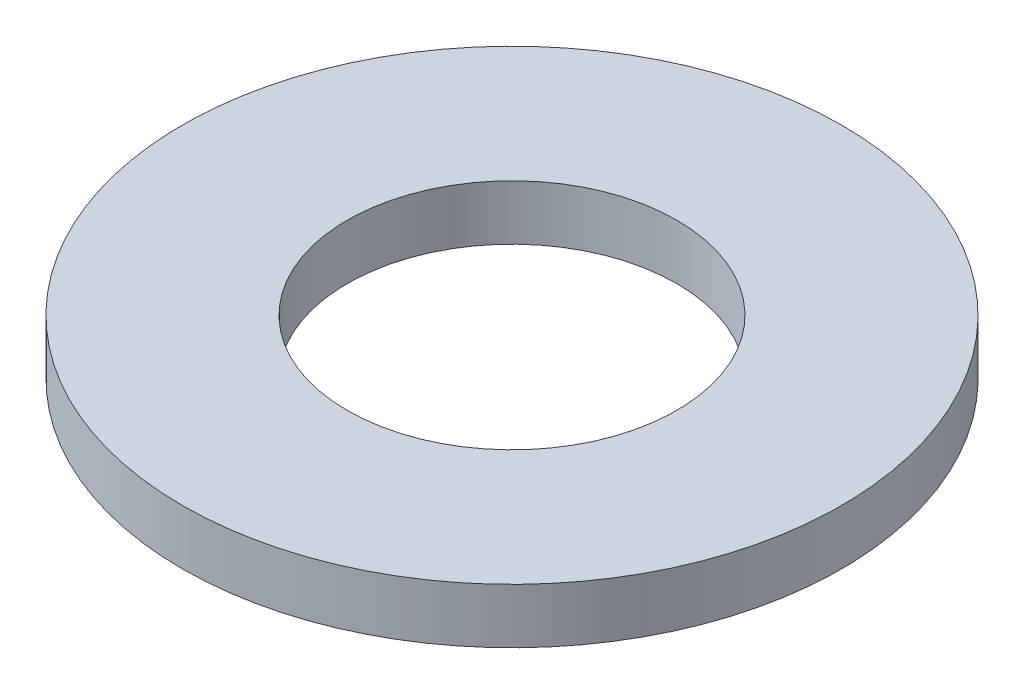
ISO-10303-21;
HEADER;
FILE_DESCRIPTION(('STEP AP214'),'2;1');
FILE_NAME('part.step','',(''),(''),'','','');
FILE_SCHEMA(('AUTOMOTIVE_DESIGN { 1 0 10303 214 1 1 1 1 }'));
ENDSEC;
DATA;
#1=APPLICATION_CONTEXT('core data for automotive mechanical design processes');
#2=APPLICATION_PROTOCOL_DEFINITION('international standard','automotive_design',2000,#1);
#3=PRODUCT_CONTEXT('',#1,'mechanical');
#4=PRODUCT('Part','Part','',(#3));
#5=PRODUCT_RELATED_PRODUCT_CATEGORY('part','',(#4));
#6=PRODUCT_DEFINITION_FORMATION('','',#4);
#7=PRODUCT_DEFINITION_CONTEXT('part definition',#1,'design');
#8=PRODUCT_DEFINITION('design','',#6,#7);
#9=PRODUCT_DEFINITION_SHAPE('','',#8);
#10=(LENGTH_UNIT() NAMED_UNIT(*) SI_UNIT(.MILLI.,.METRE.));
#11=(NAMED_UNIT(*) PLANE_ANGLE_UNIT() SI_UNIT($,.RADIAN.));
#12=(NAMED_UNIT(*) SI_UNIT($,.STERADIAN.) SOLID_ANGLE_UNIT());
#13=UNCERTAINTY_MEASURE_WITH_UNIT(LENGTH_MEASURE(1.E-05),#10,'distance_accuracy_value','');
#14=(GEOMETRIC_REPRESENTATION_CONTEXT(3) GLOBAL_UNCERTAINTY_ASSIGNED_CONTEXT((#13)) GLOBAL_UNIT_ASSIGNED_CONTEXT((#10,
#11,#12)) REPRESENTATION_CONTEXT('',''));
#15=CARTESIAN_POINT('',(0.,0.,0.));
#16=DIRECTION('',(0.,0.,1.));
#17=DIRECTION('',(1.,0.,0.));
#18=AXIS2_PLACEMENT_3D('',#15,#16,#17);
#19=CARTESIAN_POINT('',(0.,1.5875,0.));
#20=DIRECTION('',(0.,1.,0.));
#21=DIRECTION('',(0.,0.,1.));
#22=AXIS2_PLACEMENT_3D('',#19,#20,#21);
#23=PLANE('',#22);
#24=CARTESIAN_POINT('',(0.,1.5875,0.));
#25=DIRECTION('',(0.,1.,0.));
#26=DIRECTION('',(0.,0.,1.));
#27=AXIS2_PLACEMENT_3D('',#24,#25,#26);
#28=CIRCLE('',#27,9.525);
#29=CARTESIAN_POINT('',(0.,1.5875,9.525));
#30=VERTEX_POINT('',#29);
#31=EDGE_CURVE('E10',#30,#30,#28,.T.);
#32=ORIENTED_EDGE('',*,*,#31,.T.);
#33=EDGE_LOOP('',(#32));
#34=FACE_BOUND('',#33,.T.);
#35=CARTESIAN_POINT('',(0.,1.5875,0.));
#36=DIRECTION('',(0.,1.,0.));
#37=DIRECTION('',(0.,0.,1.));
#38=AXIS2_PLACEMENT_3D('',#35,#36,#37);
#39=CIRCLE('',#38,4.7625);
#40=CARTESIAN_POINT('',(0.,1.5875,4.7625));
#41=VERTEX_POINT('',#40);
#42=EDGE_CURVE('E41',#41,#41,#39,.T.);
#43=ORIENTED_EDGE('',*,*,#42,.F.);
#44=EDGE_LOOP('',(#43));
#45=FACE_BOUND('',#44,.T.);
#46=ADVANCED_FACE('F30',(#34,#45),#23,.T.);
#47=CARTESIAN_POINT('',(0.,0.,0.));
#48=DIRECTION('',(0.,1.,0.));
#49=DIRECTION('',(0.,0.,1.));
#50=AXIS2_PLACEMENT_3D('',#47,#48,#49);
#51=PLANE('',#50);
#52=CARTESIAN_POINT('',(0.,0.,0.));
#53=DIRECTION('',(0.,1.,0.));
#54=DIRECTION('',(0.,0.,1.));
#55=AXIS2_PLACEMENT_3D('',#52,#53,#54);
#56=CIRCLE('',#55,9.525);
#57=CARTESIAN_POINT('',(0.,0.,9.525));
#58=VERTEX_POINT('',#57);
#59=EDGE_CURVE('E34',#58,#58,#56,.T.);
#60=ORIENTED_EDGE('',*,*,#59,.F.);
#61=EDGE_LOOP('',(#60));
#62=FACE_BOUND('',#61,.T.);
#63=CARTESIAN_POINT('',(0.,0.,0.));
#64=DIRECTION('',(0.,1.,0.));
#65=DIRECTION('',(0.,0.,1.));
#66=AXIS2_PLACEMENT_3D('',#63,#64,#65);
#67=CIRCLE('',#66,4.7625);
#68=CARTESIAN_POINT('',(0.,0.,4.7625));
#69=VERTEX_POINT('',#68);
#70=EDGE_CURVE('E43',#69,#69,#67,.T.);
#71=ORIENTED_EDGE('',*,*,#70,.T.);
#72=EDGE_LOOP('',(#71));
#73=FACE_BOUND('',#72,.T.);
#74=ADVANCED_FACE('F53',(#62,#73),#51,.F.);
#75=CARTESIAN_POINT('',(0.,1.5875,0.));
#76=DIRECTION('',(0.,-1.,0.));
#77=DIRECTION('',(0.,0.,-1.));
#78=AXIS2_PLACEMENT_3D('',#75,#76,#77);
#79=CYLINDRICAL_SURFACE('',#78,9.525);
#80=ORIENTED_EDGE('',*,*,#31,.F.);
#81=EDGE_LOOP('',(#80));
#82=FACE_BOUND('',#81,.T.);
#83=ORIENTED_EDGE('',*,*,#59,.T.);
#84=EDGE_LOOP('',(#83));
#85=FACE_BOUND('',#84,.T.);
#86=ADVANCED_FACE('F32',(#82,#85),#79,.T.);
#87=CARTESIAN_POINT('',(0.,1.5875,0.));
#88=DIRECTION('',(0.,-1.,0.));
#89=DIRECTION('',(0.,0.,-1.));
#90=AXIS2_PLACEMENT_3D('',#87,#88,#89);
#91=CYLINDRICAL_SURFACE('',#90,4.7625);
#92=ORIENTED_EDGE('',*,*,#42,.T.);
#93=EDGE_LOOP('',(#92));
#94=FACE_BOUND('',#93,.T.);
#95=ORIENTED_EDGE('',*,*,#70,.F.);
#96=EDGE_LOOP('',(#95));
#97=FACE_BOUND('',#96,.T.);
#98=ADVANCED_FACE('F49',(#94,#97),#91,.F.);
#99=CLOSED_SHELL('',(#46,#74,#86,#98));
#100=MANIFOLD_SOLID_BREP('B2',#99);
#101=ADVANCED_BREP_SHAPE_REPRESENTATION('',(#18,#100),#14);
#102=SHAPE_DEFINITION_REPRESENTATION(#9,#101);
ENDSEC;
END-ISO-10303-21;
